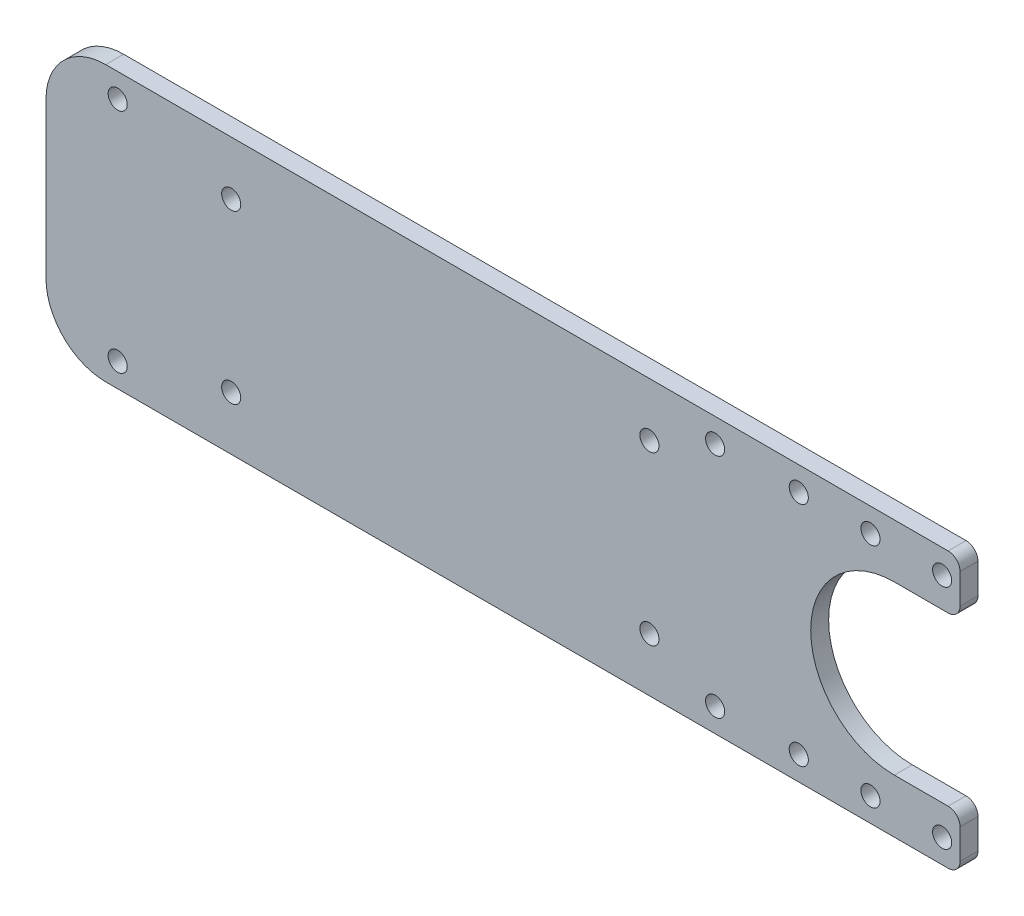
ISO-10303-21;
HEADER;
FILE_DESCRIPTION(('STEP AP214'),'2;1');
FILE_NAME('part.step','',(''),(''),'','','');
FILE_SCHEMA(('AUTOMOTIVE_DESIGN { 1 0 10303 214 1 1 1 1 }'));
ENDSEC;
DATA;
#1=APPLICATION_CONTEXT('core data for automotive mechanical design processes');
#2=APPLICATION_PROTOCOL_DEFINITION('international standard','automotive_design',2000,#1);
#3=PRODUCT_CONTEXT('',#1,'mechanical');
#4=PRODUCT('Part','Part','',(#3));
#5=PRODUCT_RELATED_PRODUCT_CATEGORY('part','',(#4));
#6=PRODUCT_DEFINITION_FORMATION('','',#4);
#7=PRODUCT_DEFINITION_CONTEXT('part definition',#1,'design');
#8=PRODUCT_DEFINITION('design','',#6,#7);
#9=PRODUCT_DEFINITION_SHAPE('','',#8);
#10=(LENGTH_UNIT() NAMED_UNIT(*) SI_UNIT(.MILLI.,.METRE.));
#11=(NAMED_UNIT(*) PLANE_ANGLE_UNIT() SI_UNIT($,.RADIAN.));
#12=(NAMED_UNIT(*) SI_UNIT($,.STERADIAN.) SOLID_ANGLE_UNIT());
#13=UNCERTAINTY_MEASURE_WITH_UNIT(LENGTH_MEASURE(1.E-05),#10,'distance_accuracy_value','');
#14=(GEOMETRIC_REPRESENTATION_CONTEXT(3) GLOBAL_UNCERTAINTY_ASSIGNED_CONTEXT((#13)) GLOBAL_UNIT_ASSIGNED_CONTEXT((#10,
#11,#12)) REPRESENTATION_CONTEXT('',''));
#15=CARTESIAN_POINT('',(0.,0.,0.));
#16=DIRECTION('',(0.,0.,1.));
#17=DIRECTION('',(1.,0.,0.));
#18=AXIS2_PLACEMENT_3D('',#15,#16,#17);
#19=CARTESIAN_POINT('',(0.,0.,3.));
#20=DIRECTION('',(0.,0.,1.));
#21=DIRECTION('',(1.,0.,0.));
#22=AXIS2_PLACEMENT_3D('',#19,#20,#21);
#23=PLANE('',#22);
#24=CARTESIAN_POINT('',(82.,-19.,3.));
#25=DIRECTION('',(0.,0.,1.));
#26=DIRECTION('',(1.,0.,0.));
#27=AXIS2_PLACEMENT_3D('',#24,#25,#26);
#28=CIRCLE('',#27,1.6);
#29=CARTESIAN_POINT('',(83.6000000000001,-19.,3.));
#30=VERTEX_POINT('',#29);
#31=EDGE_CURVE('E215',#30,#30,#28,.T.);
#32=ORIENTED_EDGE('',*,*,#31,.F.);
#33=EDGE_LOOP('',(#32));
#34=FACE_BOUND('',#33,.T.);
#35=CARTESIAN_POINT('',(82.,19.,3.));
#36=DIRECTION('',(0.,0.,1.));
#37=DIRECTION('',(1.,0.,0.));
#38=AXIS2_PLACEMENT_3D('',#35,#36,#37);
#39=CIRCLE('',#38,1.6);
#40=CARTESIAN_POINT('',(83.6000000000001,19.,3.));
#41=VERTEX_POINT('',#40);
#42=EDGE_CURVE('E221',#41,#41,#39,.T.);
#43=ORIENTED_EDGE('',*,*,#42,.F.);
#44=EDGE_LOOP('',(#43));
#45=FACE_BOUND('',#44,.T.);
#46=CARTESIAN_POINT('',(70.,19.,3.));
#47=DIRECTION('',(0.,0.,1.));
#48=DIRECTION('',(1.,0.,0.));
#49=AXIS2_PLACEMENT_3D('',#46,#47,#48);
#50=CIRCLE('',#49,1.6);
#51=CARTESIAN_POINT('',(71.6,19.,3.));
#52=VERTEX_POINT('',#51);
#53=EDGE_CURVE('E227',#52,#52,#50,.T.);
#54=ORIENTED_EDGE('',*,*,#53,.F.);
#55=EDGE_LOOP('',(#54));
#56=FACE_BOUND('',#55,.T.);
#57=CARTESIAN_POINT('',(-44.,19.,3.));
#58=DIRECTION('',(0.,0.,1.));
#59=DIRECTION('',(1.,0.,0.));
#60=AXIS2_PLACEMENT_3D('',#57,#58,#59);
#61=CIRCLE('',#60,1.6);
#62=CARTESIAN_POINT('',(-42.4,19.,3.));
#63=VERTEX_POINT('',#62);
#64=EDGE_CURVE('E194',#63,#63,#61,.T.);
#65=ORIENTED_EDGE('',*,*,#64,.F.);
#66=EDGE_LOOP('',(#65));
#67=FACE_BOUND('',#66,.T.);
#68=CARTESIAN_POINT('',(56.,-19.,3.));
#69=DIRECTION('',(0.,0.,1.));
#70=DIRECTION('',(1.,0.,0.));
#71=AXIS2_PLACEMENT_3D('',#68,#69,#70);
#72=CIRCLE('',#71,1.6);
#73=CARTESIAN_POINT('',(57.6,-19.,3.));
#74=VERTEX_POINT('',#73);
#75=EDGE_CURVE('E201',#74,#74,#72,.F.);
#76=ORIENTED_EDGE('',*,*,#75,.T.);
#77=EDGE_LOOP('',(#76));
#78=FACE_BOUND('',#77,.T.);
#79=CARTESIAN_POINT('',(56.,19.,3.));
#80=DIRECTION('',(0.,0.,1.));
#81=DIRECTION('',(1.,0.,0.));
#82=AXIS2_PLACEMENT_3D('',#79,#80,#81);
#83=CIRCLE('',#82,1.6);
#84=CARTESIAN_POINT('',(57.6,19.,3.));
#85=VERTEX_POINT('',#84);
#86=EDGE_CURVE('E158',#85,#85,#83,.T.);
#87=ORIENTED_EDGE('',*,*,#86,.F.);
#88=EDGE_LOOP('',(#87));
#89=FACE_BOUND('',#88,.T.);
#90=DIRECTION('',(0.,1.,0.));
#91=VECTOR('',#90,1.);
#92=CARTESIAN_POINT('',(-56.,0.,3.));
#93=LINE('',#92,#91);
#94=CARTESIAN_POINT('',(-56.,-13.,3.));
#95=VERTEX_POINT('',#94);
#96=CARTESIAN_POINT('',(-56.,13.,3.));
#97=VERTEX_POINT('',#96);
#98=EDGE_CURVE('E251',#95,#97,#93,.T.);
#99=ORIENTED_EDGE('',*,*,#98,.F.);
#100=CARTESIAN_POINT('',(-46.,-13.,3.));
#101=DIRECTION('',(0.,0.,1.));
#102=DIRECTION('',(1.,0.,0.));
#103=AXIS2_PLACEMENT_3D('',#100,#101,#102);
#104=CIRCLE('',#103,10.);
#105=CARTESIAN_POINT('',(-46.,-23.,3.));
#106=VERTEX_POINT('',#105);
#107=EDGE_CURVE('E43',#95,#106,#104,.T.);
#108=ORIENTED_EDGE('',*,*,#107,.T.);
#109=DIRECTION('',(-1.,0.,0.));
#110=VECTOR('',#109,1.);
#111=CARTESIAN_POINT('',(0.,-23.,3.));
#112=LINE('',#111,#110);
#113=CARTESIAN_POINT('',(95.,-23.,3.));
#114=VERTEX_POINT('',#113);
#115=EDGE_CURVE('E253',#114,#106,#112,.T.);
#116=ORIENTED_EDGE('',*,*,#115,.F.);
#117=CARTESIAN_POINT('',(95.,-21.,3.));
#118=DIRECTION('',(0.,0.,1.));
#119=DIRECTION('',(1.,0.,0.));
#120=AXIS2_PLACEMENT_3D('',#117,#118,#119);
#121=CIRCLE('',#120,2.);
#122=CARTESIAN_POINT('',(97.,-21.,3.));
#123=VERTEX_POINT('',#122);
#124=EDGE_CURVE('E282',#114,#123,#121,.T.);
#125=ORIENTED_EDGE('',*,*,#124,.T.);
#126=DIRECTION('',(0.,-1.,0.));
#127=VECTOR('',#126,1.);
#128=CARTESIAN_POINT('',(96.9999999999999,4.48715139119334E-13,3.));
#129=LINE('',#128,#127);
#130=CARTESIAN_POINT('',(97.,-16.,3.));
#131=VERTEX_POINT('',#130);
#132=EDGE_CURVE('E168',#131,#123,#129,.T.);
#133=ORIENTED_EDGE('',*,*,#132,.F.);
#134=CARTESIAN_POINT('',(95.,-16.,3.));
#135=DIRECTION('',(0.,0.,1.));
#136=DIRECTION('',(1.,0.,0.));
#137=AXIS2_PLACEMENT_3D('',#134,#135,#136);
#138=CIRCLE('',#137,2.);
#139=CARTESIAN_POINT('',(95.,-14.,3.));
#140=VERTEX_POINT('',#139);
#141=EDGE_CURVE('E162',#131,#140,#138,.T.);
#142=ORIENTED_EDGE('',*,*,#141,.T.);
#143=DIRECTION('',(1.,0.,0.));
#144=VECTOR('',#143,1.);
#145=CARTESIAN_POINT('',(0.,-14.0000000000001,3.));
#146=LINE('',#145,#144);
#147=CARTESIAN_POINT('',(86.,-14.,3.));
#148=VERTEX_POINT('',#147);
#149=EDGE_CURVE('E154',#148,#140,#146,.T.);
#150=ORIENTED_EDGE('',*,*,#149,.F.);
#151=CARTESIAN_POINT('',(86.,0.,3.));
#152=DIRECTION('',(0.,0.,1.));
#153=DIRECTION('',(1.,0.,0.));
#154=AXIS2_PLACEMENT_3D('',#151,#152,#153);
#155=CIRCLE('',#154,14.);
#156=CARTESIAN_POINT('',(86.,14.,3.));
#157=VERTEX_POINT('',#156);
#158=EDGE_CURVE('E138',#157,#148,#155,.T.);
#159=ORIENTED_EDGE('',*,*,#158,.F.);
#160=DIRECTION('',(1.,0.,0.));
#161=VECTOR('',#160,1.);
#162=CARTESIAN_POINT('',(0.,14.0000000000001,3.));
#163=LINE('',#162,#161);
#164=CARTESIAN_POINT('',(95.,14.,3.));
#165=VERTEX_POINT('',#164);
#166=EDGE_CURVE('E188',#157,#165,#163,.T.);
#167=ORIENTED_EDGE('',*,*,#166,.T.);
#168=CARTESIAN_POINT('',(95.,16.,3.));
#169=DIRECTION('',(0.,0.,1.));
#170=DIRECTION('',(1.,0.,0.));
#171=AXIS2_PLACEMENT_3D('',#168,#169,#170);
#172=CIRCLE('',#171,2.);
#173=CARTESIAN_POINT('',(97.,16.,3.));
#174=VERTEX_POINT('',#173);
#175=EDGE_CURVE('E301',#165,#174,#172,.T.);
#176=ORIENTED_EDGE('',*,*,#175,.T.);
#177=DIRECTION('',(0.,1.,0.));
#178=VECTOR('',#177,1.);
#179=CARTESIAN_POINT('',(96.9999999999999,-5.98286852159113E-13,3.));
#180=LINE('',#179,#178);
#181=CARTESIAN_POINT('',(97.,21.,3.));
#182=VERTEX_POINT('',#181);
#183=EDGE_CURVE('E181',#174,#182,#180,.T.);
#184=ORIENTED_EDGE('',*,*,#183,.T.);
#185=CARTESIAN_POINT('',(95.,21.,3.));
#186=DIRECTION('',(0.,0.,1.));
#187=DIRECTION('',(1.,0.,0.));
#188=AXIS2_PLACEMENT_3D('',#185,#186,#187);
#189=CIRCLE('',#188,2.);
#190=CARTESIAN_POINT('',(95.,23.,3.));
#191=VERTEX_POINT('',#190);
#192=EDGE_CURVE('E285',#182,#191,#189,.T.);
#193=ORIENTED_EDGE('',*,*,#192,.T.);
#194=DIRECTION('',(-1.,0.,0.));
#195=VECTOR('',#194,1.);
#196=CARTESIAN_POINT('',(0.,23.,3.));
#197=LINE('',#196,#195);
#198=CARTESIAN_POINT('',(-46.,23.,3.));
#199=VERTEX_POINT('',#198);
#200=EDGE_CURVE('E256',#191,#199,#197,.T.);
#201=ORIENTED_EDGE('',*,*,#200,.T.);
#202=CARTESIAN_POINT('',(-46.,13.,3.));
#203=DIRECTION('',(0.,0.,1.));
#204=DIRECTION('',(1.,0.,0.));
#205=AXIS2_PLACEMENT_3D('',#202,#203,#204);
#206=CIRCLE('',#205,10.);
#207=EDGE_CURVE('E55',#199,#97,#206,.T.);
#208=ORIENTED_EDGE('',*,*,#207,.T.);
#209=EDGE_LOOP('',(#99,#108,#116,#125,#133,#142,#150,#159,#167,#176,#184,#193,#201,#208));
#210=FACE_BOUND('',#209,.T.);
#211=CARTESIAN_POINT('',(70.,-19.,3.));
#212=DIRECTION('',(0.,0.,1.));
#213=DIRECTION('',(1.,0.,0.));
#214=AXIS2_PLACEMENT_3D('',#211,#212,#213);
#215=CIRCLE('',#214,1.6);
#216=CARTESIAN_POINT('',(71.6,-19.,3.));
#217=VERTEX_POINT('',#216);
#218=EDGE_CURVE('E214',#217,#217,#215,.T.);
#219=ORIENTED_EDGE('',*,*,#218,.F.);
#220=EDGE_LOOP('',(#219));
#221=FACE_BOUND('',#220,.T.);
#222=CARTESIAN_POINT('',(45.,-14.,3.));
#223=DIRECTION('',(0.,0.,1.));
#224=DIRECTION('',(1.,0.,0.));
#225=AXIS2_PLACEMENT_3D('',#222,#223,#224);
#226=CIRCLE('',#225,1.6);
#227=CARTESIAN_POINT('',(46.6,-14.,3.));
#228=VERTEX_POINT('',#227);
#229=EDGE_CURVE('E241',#228,#228,#226,.T.);
#230=ORIENTED_EDGE('',*,*,#229,.F.);
#231=EDGE_LOOP('',(#230));
#232=FACE_BOUND('',#231,.T.);
#233=CARTESIAN_POINT('',(-25.,14.,3.));
#234=DIRECTION('',(0.,0.,1.));
#235=DIRECTION('',(1.,0.,0.));
#236=AXIS2_PLACEMENT_3D('',#233,#234,#235);
#237=CIRCLE('',#236,1.6);
#238=CARTESIAN_POINT('',(-23.4,14.,3.));
#239=VERTEX_POINT('',#238);
#240=EDGE_CURVE('E244',#239,#239,#237,.T.);
#241=ORIENTED_EDGE('',*,*,#240,.F.);
#242=EDGE_LOOP('',(#241));
#243=FACE_BOUND('',#242,.T.);
#244=CARTESIAN_POINT('',(-25.,-14.,3.));
#245=DIRECTION('',(0.,0.,1.));
#246=DIRECTION('',(1.,0.,0.));
#247=AXIS2_PLACEMENT_3D('',#244,#245,#246);
#248=CIRCLE('',#247,1.6);
#249=CARTESIAN_POINT('',(-23.4,-14.,3.));
#250=VERTEX_POINT('',#249);
#251=EDGE_CURVE('E248',#250,#250,#248,.F.);
#252=ORIENTED_EDGE('',*,*,#251,.T.);
#253=EDGE_LOOP('',(#252));
#254=FACE_BOUND('',#253,.T.);
#255=CARTESIAN_POINT('',(45.,14.,3.));
#256=DIRECTION('',(0.,0.,1.));
#257=DIRECTION('',(1.,0.,0.));
#258=AXIS2_PLACEMENT_3D('',#255,#256,#257);
#259=CIRCLE('',#258,1.6);
#260=CARTESIAN_POINT('',(46.6,14.,3.));
#261=VERTEX_POINT('',#260);
#262=EDGE_CURVE('E258',#261,#261,#259,.F.);
#263=ORIENTED_EDGE('',*,*,#262,.T.);
#264=EDGE_LOOP('',(#263));
#265=FACE_BOUND('',#264,.T.);
#266=CARTESIAN_POINT('',(-44.,-19.,3.));
#267=DIRECTION('',(0.,0.,1.));
#268=DIRECTION('',(1.,0.,0.));
#269=AXIS2_PLACEMENT_3D('',#266,#267,#268);
#270=CIRCLE('',#269,1.6);
#271=CARTESIAN_POINT('',(-42.4,-19.,3.));
#272=VERTEX_POINT('',#271);
#273=EDGE_CURVE('E195',#272,#272,#270,.F.);
#274=ORIENTED_EDGE('',*,*,#273,.T.);
#275=EDGE_LOOP('',(#274));
#276=FACE_BOUND('',#275,.T.);
#277=CARTESIAN_POINT('',(94.,19.,3.));
#278=DIRECTION('',(0.,0.,1.));
#279=DIRECTION('',(1.,0.,0.));
#280=AXIS2_PLACEMENT_3D('',#277,#278,#279);
#281=CIRCLE('',#280,1.6);
#282=CARTESIAN_POINT('',(95.6000000000001,19.,3.));
#283=VERTEX_POINT('',#282);
#284=EDGE_CURVE('E177',#283,#283,#281,.T.);
#285=ORIENTED_EDGE('',*,*,#284,.F.);
#286=EDGE_LOOP('',(#285));
#287=FACE_BOUND('',#286,.T.);
#288=CARTESIAN_POINT('',(94.,-19.,3.));
#289=DIRECTION('',(0.,0.,1.));
#290=DIRECTION('',(1.,0.,0.));
#291=AXIS2_PLACEMENT_3D('',#288,#289,#290);
#292=CIRCLE('',#291,1.59999999999999);
#293=CARTESIAN_POINT('',(95.6,-19.,3.));
#294=VERTEX_POINT('',#293);
#295=EDGE_CURVE('E163',#294,#294,#292,.F.);
#296=ORIENTED_EDGE('',*,*,#295,.T.);
#297=EDGE_LOOP('',(#296));
#298=FACE_BOUND('',#297,.T.);
#299=ADVANCED_FACE('F35',(#34,#45,#56,#67,#78,#89,#210,#221,#232,#243,#254,#265,#276,#287,#298),
#23,.T.);
#300=CARTESIAN_POINT('',(0.,0.,0.));
#301=DIRECTION('',(0.,0.,1.));
#302=DIRECTION('',(1.,0.,0.));
#303=AXIS2_PLACEMENT_3D('',#300,#301,#302);
#304=PLANE('',#303);
#305=CARTESIAN_POINT('',(82.,-19.,0.));
#306=DIRECTION('',(0.,0.,1.));
#307=DIRECTION('',(1.,0.,0.));
#308=AXIS2_PLACEMENT_3D('',#305,#306,#307);
#309=CIRCLE('',#308,1.6);
#310=CARTESIAN_POINT('',(83.6000000000001,-19.,0.));
#311=VERTEX_POINT('',#310);
#312=EDGE_CURVE('E211',#311,#311,#309,.T.);
#313=ORIENTED_EDGE('',*,*,#312,.T.);
#314=EDGE_LOOP('',(#313));
#315=FACE_BOUND('',#314,.T.);
#316=CARTESIAN_POINT('',(82.,19.,0.));
#317=DIRECTION('',(0.,0.,1.));
#318=DIRECTION('',(1.,0.,0.));
#319=AXIS2_PLACEMENT_3D('',#316,#317,#318);
#320=CIRCLE('',#319,1.6);
#321=CARTESIAN_POINT('',(83.6000000000001,19.,0.));
#322=VERTEX_POINT('',#321);
#323=EDGE_CURVE('E218',#322,#322,#320,.T.);
#324=ORIENTED_EDGE('',*,*,#323,.T.);
#325=EDGE_LOOP('',(#324));
#326=FACE_BOUND('',#325,.T.);
#327=CARTESIAN_POINT('',(70.,19.,0.));
#328=DIRECTION('',(0.,0.,1.));
#329=DIRECTION('',(1.,0.,0.));
#330=AXIS2_PLACEMENT_3D('',#327,#328,#329);
#331=CIRCLE('',#330,1.6);
#332=CARTESIAN_POINT('',(71.6,19.,0.));
#333=VERTEX_POINT('',#332);
#334=EDGE_CURVE('E224',#333,#333,#331,.T.);
#335=ORIENTED_EDGE('',*,*,#334,.T.);
#336=EDGE_LOOP('',(#335));
#337=FACE_BOUND('',#336,.T.);
#338=CARTESIAN_POINT('',(-44.,19.,0.));
#339=DIRECTION('',(0.,0.,1.));
#340=DIRECTION('',(1.,0.,0.));
#341=AXIS2_PLACEMENT_3D('',#338,#339,#340);
#342=CIRCLE('',#341,1.6);
#343=CARTESIAN_POINT('',(-42.4,19.,0.));
#344=VERTEX_POINT('',#343);
#345=EDGE_CURVE('E230',#344,#344,#342,.T.);
#346=ORIENTED_EDGE('',*,*,#345,.T.);
#347=EDGE_LOOP('',(#346));
#348=FACE_BOUND('',#347,.T.);
#349=CARTESIAN_POINT('',(56.,19.,0.));
#350=DIRECTION('',(0.,0.,1.));
#351=DIRECTION('',(1.,0.,0.));
#352=AXIS2_PLACEMENT_3D('',#349,#350,#351);
#353=CIRCLE('',#352,1.6);
#354=CARTESIAN_POINT('',(57.6,19.,0.));
#355=VERTEX_POINT('',#354);
#356=EDGE_CURVE('E204',#355,#355,#353,.T.);
#357=ORIENTED_EDGE('',*,*,#356,.T.);
#358=EDGE_LOOP('',(#357));
#359=FACE_BOUND('',#358,.T.);
#360=CARTESIAN_POINT('',(70.,-19.,0.));
#361=DIRECTION('',(0.,0.,1.));
#362=DIRECTION('',(1.,0.,0.));
#363=AXIS2_PLACEMENT_3D('',#360,#361,#362);
#364=CIRCLE('',#363,1.6);
#365=CARTESIAN_POINT('',(71.6,-19.,0.));
#366=VERTEX_POINT('',#365);
#367=EDGE_CURVE('E235',#366,#366,#364,.T.);
#368=ORIENTED_EDGE('',*,*,#367,.T.);
#369=EDGE_LOOP('',(#368));
#370=FACE_BOUND('',#369,.T.);
#371=CARTESIAN_POINT('',(45.,-14.,0.));
#372=DIRECTION('',(0.,0.,1.));
#373=DIRECTION('',(1.,0.,0.));
#374=AXIS2_PLACEMENT_3D('',#371,#372,#373);
#375=CIRCLE('',#374,1.6);
#376=CARTESIAN_POINT('',(46.6,-14.,0.));
#377=VERTEX_POINT('',#376);
#378=EDGE_CURVE('E238',#377,#377,#375,.T.);
#379=ORIENTED_EDGE('',*,*,#378,.T.);
#380=EDGE_LOOP('',(#379));
#381=FACE_BOUND('',#380,.T.);
#382=CARTESIAN_POINT('',(-25.,14.,0.));
#383=DIRECTION('',(0.,0.,1.));
#384=DIRECTION('',(1.,0.,0.));
#385=AXIS2_PLACEMENT_3D('',#382,#383,#384);
#386=CIRCLE('',#385,1.6);
#387=CARTESIAN_POINT('',(-23.4,14.,0.));
#388=VERTEX_POINT('',#387);
#389=EDGE_CURVE('E264',#388,#388,#386,.T.);
#390=ORIENTED_EDGE('',*,*,#389,.T.);
#391=EDGE_LOOP('',(#390));
#392=FACE_BOUND('',#391,.T.);
#393=CARTESIAN_POINT('',(-25.,-14.,0.));
#394=DIRECTION('',(0.,0.,1.));
#395=DIRECTION('',(1.,0.,0.));
#396=AXIS2_PLACEMENT_3D('',#393,#394,#395);
#397=CIRCLE('',#396,1.6);
#398=CARTESIAN_POINT('',(-23.4,-14.,0.));
#399=VERTEX_POINT('',#398);
#400=EDGE_CURVE('E267',#399,#399,#397,.F.);
#401=ORIENTED_EDGE('',*,*,#400,.F.);
#402=EDGE_LOOP('',(#401));
#403=FACE_BOUND('',#402,.T.);
#404=DIRECTION('',(-1.,0.,0.));
#405=VECTOR('',#404,1.);
#406=CARTESIAN_POINT('',(0.,-23.,0.));
#407=LINE('',#406,#405);
#408=CARTESIAN_POINT('',(95.,-23.,0.));
#409=VERTEX_POINT('',#408);
#410=CARTESIAN_POINT('',(-46.,-23.,0.));
#411=VERTEX_POINT('',#410);
#412=EDGE_CURVE('E273',#409,#411,#407,.T.);
#413=ORIENTED_EDGE('',*,*,#412,.T.);
#414=CARTESIAN_POINT('',(-46.,-13.,0.));
#415=DIRECTION('',(0.,0.,1.));
#416=DIRECTION('',(1.,0.,0.));
#417=AXIS2_PLACEMENT_3D('',#414,#415,#416);
#418=CIRCLE('',#417,10.);
#419=CARTESIAN_POINT('',(-56.,-13.,0.));
#420=VERTEX_POINT('',#419);
#421=EDGE_CURVE('E320',#411,#420,#418,.F.);
#422=ORIENTED_EDGE('',*,*,#421,.T.);
#423=DIRECTION('',(0.,1.,0.));
#424=VECTOR('',#423,1.);
#425=CARTESIAN_POINT('',(-56.,0.,0.));
#426=LINE('',#425,#424);
#427=CARTESIAN_POINT('',(-56.,13.,0.));
#428=VERTEX_POINT('',#427);
#429=EDGE_CURVE('E270',#420,#428,#426,.T.);
#430=ORIENTED_EDGE('',*,*,#429,.T.);
#431=CARTESIAN_POINT('',(-46.,13.,0.));
#432=DIRECTION('',(0.,0.,1.));
#433=DIRECTION('',(1.,0.,0.));
#434=AXIS2_PLACEMENT_3D('',#431,#432,#433);
#435=CIRCLE('',#434,10.);
#436=CARTESIAN_POINT('',(-46.,23.,0.));
#437=VERTEX_POINT('',#436);
#438=EDGE_CURVE('E318',#428,#437,#435,.F.);
#439=ORIENTED_EDGE('',*,*,#438,.T.);
#440=DIRECTION('',(-1.,0.,0.));
#441=VECTOR('',#440,1.);
#442=CARTESIAN_POINT('',(0.,23.,0.));
#443=LINE('',#442,#441);
#444=CARTESIAN_POINT('',(95.,23.,0.));
#445=VERTEX_POINT('',#444);
#446=EDGE_CURVE('E276',#445,#437,#443,.T.);
#447=ORIENTED_EDGE('',*,*,#446,.F.);
#448=CARTESIAN_POINT('',(95.,21.,0.));
#449=DIRECTION('',(0.,0.,1.));
#450=DIRECTION('',(1.,0.,0.));
#451=AXIS2_PLACEMENT_3D('',#448,#449,#450);
#452=CIRCLE('',#451,2.);
#453=CARTESIAN_POINT('',(97.,21.,0.));
#454=VERTEX_POINT('',#453);
#455=EDGE_CURVE('E291',#445,#454,#452,.F.);
#456=ORIENTED_EDGE('',*,*,#455,.T.);
#457=DIRECTION('',(0.,-1.,0.));
#458=VECTOR('',#457,1.);
#459=CARTESIAN_POINT('',(96.9999999999999,-5.98286852159113E-13,0.));
#460=LINE('',#459,#458);
#461=CARTESIAN_POINT('',(97.,16.,0.));
#462=VERTEX_POINT('',#461);
#463=EDGE_CURVE('E180',#454,#462,#460,.T.);
#464=ORIENTED_EDGE('',*,*,#463,.T.);
#465=CARTESIAN_POINT('',(95.,16.,0.));
#466=DIRECTION('',(0.,0.,1.));
#467=DIRECTION('',(1.,0.,0.));
#468=AXIS2_PLACEMENT_3D('',#465,#466,#467);
#469=CIRCLE('',#468,2.);
#470=CARTESIAN_POINT('',(95.,14.,0.));
#471=VERTEX_POINT('',#470);
#472=EDGE_CURVE('E306',#462,#471,#469,.F.);
#473=ORIENTED_EDGE('',*,*,#472,.T.);
#474=DIRECTION('',(-1.,0.,0.));
#475=VECTOR('',#474,1.);
#476=CARTESIAN_POINT('',(0.,14.0000000000001,0.));
#477=LINE('',#476,#475);
#478=CARTESIAN_POINT('',(86.,14.,0.));
#479=VERTEX_POINT('',#478);
#480=EDGE_CURVE('E178',#471,#479,#477,.T.);
#481=ORIENTED_EDGE('',*,*,#480,.T.);
#482=CARTESIAN_POINT('',(86.,0.,0.));
#483=DIRECTION('',(0.,0.,1.));
#484=DIRECTION('',(1.,0.,0.));
#485=AXIS2_PLACEMENT_3D('',#482,#483,#484);
#486=CIRCLE('',#485,14.);
#487=CARTESIAN_POINT('',(86.,-14.,0.));
#488=VERTEX_POINT('',#487);
#489=EDGE_CURVE('E148',#479,#488,#486,.T.);
#490=ORIENTED_EDGE('',*,*,#489,.T.);
#491=DIRECTION('',(-1.,0.,0.));
#492=VECTOR('',#491,1.);
#493=CARTESIAN_POINT('',(0.,-14.0000000000001,0.));
#494=LINE('',#493,#492);
#495=CARTESIAN_POINT('',(95.,-14.,0.));
#496=VERTEX_POINT('',#495);
#497=EDGE_CURVE('E157',#496,#488,#494,.T.);
#498=ORIENTED_EDGE('',*,*,#497,.F.);
#499=CARTESIAN_POINT('',(95.,-16.,0.));
#500=DIRECTION('',(0.,0.,1.));
#501=DIRECTION('',(1.,0.,0.));
#502=AXIS2_PLACEMENT_3D('',#499,#500,#501);
#503=CIRCLE('',#502,2.);
#504=CARTESIAN_POINT('',(97.,-16.,0.));
#505=VERTEX_POINT('',#504);
#506=EDGE_CURVE('E308',#496,#505,#503,.F.);
#507=ORIENTED_EDGE('',*,*,#506,.T.);
#508=DIRECTION('',(0.,1.,0.));
#509=VECTOR('',#508,1.);
#510=CARTESIAN_POINT('',(96.9999999999999,4.48715139119334E-13,0.));
#511=LINE('',#510,#509);
#512=CARTESIAN_POINT('',(97.,-21.,0.));
#513=VERTEX_POINT('',#512);
#514=EDGE_CURVE('E172',#513,#505,#511,.T.);
#515=ORIENTED_EDGE('',*,*,#514,.F.);
#516=CARTESIAN_POINT('',(95.,-21.,0.));
#517=DIRECTION('',(0.,0.,1.));
#518=DIRECTION('',(1.,0.,0.));
#519=AXIS2_PLACEMENT_3D('',#516,#517,#518);
#520=CIRCLE('',#519,2.);
#521=EDGE_CURVE('E289',#513,#409,#520,.F.);
#522=ORIENTED_EDGE('',*,*,#521,.T.);
#523=EDGE_LOOP('',(#413,#422,#430,#439,#447,#456,#464,#473,#481,#490,#498,#507,#515,#522));
#524=FACE_BOUND('',#523,.T.);
#525=CARTESIAN_POINT('',(45.,14.,0.));
#526=DIRECTION('',(0.,0.,1.));
#527=DIRECTION('',(1.,0.,0.));
#528=AXIS2_PLACEMENT_3D('',#525,#526,#527);
#529=CIRCLE('',#528,1.6);
#530=CARTESIAN_POINT('',(46.6,14.,0.));
#531=VERTEX_POINT('',#530);
#532=EDGE_CURVE('E245',#531,#531,#529,.F.);
#533=ORIENTED_EDGE('',*,*,#532,.F.);
#534=EDGE_LOOP('',(#533));
#535=FACE_BOUND('',#534,.T.);
#536=CARTESIAN_POINT('',(56.,-19.,0.));
#537=DIRECTION('',(0.,0.,1.));
#538=DIRECTION('',(1.,0.,0.));
#539=AXIS2_PLACEMENT_3D('',#536,#537,#538);
#540=CIRCLE('',#539,1.6);
#541=CARTESIAN_POINT('',(57.6,-19.,0.));
#542=VERTEX_POINT('',#541);
#543=EDGE_CURVE('E198',#542,#542,#540,.F.);
#544=ORIENTED_EDGE('',*,*,#543,.F.);
#545=EDGE_LOOP('',(#544));
#546=FACE_BOUND('',#545,.T.);
#547=CARTESIAN_POINT('',(-44.,-19.,0.));
#548=DIRECTION('',(0.,0.,1.));
#549=DIRECTION('',(1.,0.,0.));
#550=AXIS2_PLACEMENT_3D('',#547,#548,#549);
#551=CIRCLE('',#550,1.6);
#552=CARTESIAN_POINT('',(-42.4,-19.,0.));
#553=VERTEX_POINT('',#552);
#554=EDGE_CURVE('E191',#553,#553,#551,.F.);
#555=ORIENTED_EDGE('',*,*,#554,.F.);
#556=EDGE_LOOP('',(#555));
#557=FACE_BOUND('',#556,.T.);
#558=CARTESIAN_POINT('',(94.,19.,0.));
#559=DIRECTION('',(0.,0.,1.));
#560=DIRECTION('',(1.,0.,0.));
#561=AXIS2_PLACEMENT_3D('',#558,#559,#560);
#562=CIRCLE('',#561,1.6);
#563=CARTESIAN_POINT('',(95.6000000000001,19.,0.));
#564=VERTEX_POINT('',#563);
#565=EDGE_CURVE('E149',#564,#564,#562,.F.);
#566=ORIENTED_EDGE('',*,*,#565,.F.);
#567=EDGE_LOOP('',(#566));
#568=FACE_BOUND('',#567,.T.);
#569=CARTESIAN_POINT('',(94.,-19.,0.));
#570=DIRECTION('',(0.,0.,1.));
#571=DIRECTION('',(1.,0.,0.));
#572=AXIS2_PLACEMENT_3D('',#569,#570,#571);
#573=CIRCLE('',#572,1.59999999999999);
#574=CARTESIAN_POINT('',(95.6,-19.,0.));
#575=VERTEX_POINT('',#574);
#576=EDGE_CURVE('E166',#575,#575,#573,.T.);
#577=ORIENTED_EDGE('',*,*,#576,.T.);
#578=EDGE_LOOP('',(#577));
#579=FACE_BOUND('',#578,.T.);
#580=ADVANCED_FACE('F339',(#315,#326,#337,#348,#359,#370,#381,#392,#403,#524,#535,#546,#557,
#568,#579),#304,.F.);
#581=CARTESIAN_POINT('',(-56.,0.,3.));
#582=DIRECTION('',(-1.,0.,0.));
#583=DIRECTION('',(0.,-1.,0.));
#584=AXIS2_PLACEMENT_3D('',#581,#582,#583);
#585=PLANE('',#584);
#586=ORIENTED_EDGE('',*,*,#429,.F.);
#587=DIRECTION('',(0.,0.,-1.));
#588=VECTOR('',#587,1.);
#589=CARTESIAN_POINT('',(-56.,-13.,3.));
#590=LINE('',#589,#588);
#591=EDGE_CURVE('E325',#420,#95,#590,.F.);
#592=ORIENTED_EDGE('',*,*,#591,.T.);
#593=ORIENTED_EDGE('',*,*,#98,.T.);
#594=DIRECTION('',(0.,0.,-1.));
#595=VECTOR('',#594,1.);
#596=CARTESIAN_POINT('',(-56.,13.,0.));
#597=LINE('',#596,#595);
#598=EDGE_CURVE('E322',#97,#428,#597,.T.);
#599=ORIENTED_EDGE('',*,*,#598,.T.);
#600=EDGE_LOOP('',(#586,#592,#593,#599));
#601=FACE_BOUND('',#600,.T.);
#602=ADVANCED_FACE('F342',(#601),#585,.T.);
#603=CARTESIAN_POINT('',(0.,-23.,3.));
#604=DIRECTION('',(0.,-1.,0.));
#605=DIRECTION('',(1.,0.,0.));
#606=AXIS2_PLACEMENT_3D('',#603,#604,#605);
#607=PLANE('',#606);
#608=ORIENTED_EDGE('',*,*,#115,.T.);
#609=DIRECTION('',(0.,0.,-1.));
#610=VECTOR('',#609,1.);
#611=CARTESIAN_POINT('',(-46.,-23.,3.));
#612=LINE('',#611,#610);
#613=EDGE_CURVE('E315',#106,#411,#612,.T.);
#614=ORIENTED_EDGE('',*,*,#613,.T.);
#615=ORIENTED_EDGE('',*,*,#412,.F.);
#616=DIRECTION('',(0.,0.,1.));
#617=VECTOR('',#616,1.);
#618=CARTESIAN_POINT('',(95.,-23.,3.));
#619=LINE('',#618,#617);
#620=EDGE_CURVE('E293',#409,#114,#619,.T.);
#621=ORIENTED_EDGE('',*,*,#620,.T.);
#622=EDGE_LOOP('',(#608,#614,#615,#621));
#623=FACE_BOUND('',#622,.T.);
#624=ADVANCED_FACE('F333',(#623),#607,.T.);
#625=CARTESIAN_POINT('',(0.,23.,3.));
#626=DIRECTION('',(0.,-1.,0.));
#627=DIRECTION('',(1.,0.,0.));
#628=AXIS2_PLACEMENT_3D('',#625,#626,#627);
#629=PLANE('',#628);
#630=ORIENTED_EDGE('',*,*,#446,.T.);
#631=DIRECTION('',(0.,0.,-1.));
#632=VECTOR('',#631,1.);
#633=CARTESIAN_POINT('',(-46.,23.,3.));
#634=LINE('',#633,#632);
#635=EDGE_CURVE('E11',#437,#199,#634,.F.);
#636=ORIENTED_EDGE('',*,*,#635,.T.);
#637=ORIENTED_EDGE('',*,*,#200,.F.);
#638=DIRECTION('',(0.,0.,1.));
#639=VECTOR('',#638,1.);
#640=CARTESIAN_POINT('',(95.,23.,0.));
#641=LINE('',#640,#639);
#642=EDGE_CURVE('E287',#191,#445,#641,.F.);
#643=ORIENTED_EDGE('',*,*,#642,.T.);
#644=EDGE_LOOP('',(#630,#636,#637,#643));
#645=FACE_BOUND('',#644,.T.);
#646=ADVANCED_FACE('F347',(#645),#629,.F.);
#647=CARTESIAN_POINT('',(-25.,-14.,3.));
#648=DIRECTION('',(0.,0.,-1.));
#649=DIRECTION('',(-1.,0.,0.));
#650=AXIS2_PLACEMENT_3D('',#647,#648,#649);
#651=CYLINDRICAL_SURFACE('',#650,1.6);
#652=ORIENTED_EDGE('',*,*,#251,.F.);
#653=EDGE_LOOP('',(#652));
#654=FACE_BOUND('',#653,.T.);
#655=ORIENTED_EDGE('',*,*,#400,.T.);
#656=EDGE_LOOP('',(#655));
#657=FACE_BOUND('',#656,.T.);
#658=ADVANCED_FACE('F407',(#654,#657),#651,.F.);
#659=CARTESIAN_POINT('',(-25.,14.,3.));
#660=DIRECTION('',(0.,0.,-1.));
#661=DIRECTION('',(-1.,0.,0.));
#662=AXIS2_PLACEMENT_3D('',#659,#660,#661);
#663=CYLINDRICAL_SURFACE('',#662,1.6);
#664=ORIENTED_EDGE('',*,*,#240,.T.);
#665=EDGE_LOOP('',(#664));
#666=FACE_BOUND('',#665,.T.);
#667=ORIENTED_EDGE('',*,*,#389,.F.);
#668=EDGE_LOOP('',(#667));
#669=FACE_BOUND('',#668,.T.);
#670=ADVANCED_FACE('F414',(#666,#669),#663,.F.);
#671=CARTESIAN_POINT('',(45.,-14.,3.));
#672=DIRECTION('',(0.,0.,-1.));
#673=DIRECTION('',(-1.,0.,0.));
#674=AXIS2_PLACEMENT_3D('',#671,#672,#673);
#675=CYLINDRICAL_SURFACE('',#674,1.6);
#676=ORIENTED_EDGE('',*,*,#229,.T.);
#677=EDGE_LOOP('',(#676));
#678=FACE_BOUND('',#677,.T.);
#679=ORIENTED_EDGE('',*,*,#378,.F.);
#680=EDGE_LOOP('',(#679));
#681=FACE_BOUND('',#680,.T.);
#682=ADVANCED_FACE('F403',(#678,#681),#675,.F.);
#683=CARTESIAN_POINT('',(45.,14.,3.));
#684=DIRECTION('',(0.,0.,-1.));
#685=DIRECTION('',(-1.,0.,0.));
#686=AXIS2_PLACEMENT_3D('',#683,#684,#685);
#687=CYLINDRICAL_SURFACE('',#686,1.6);
#688=ORIENTED_EDGE('',*,*,#262,.F.);
#689=EDGE_LOOP('',(#688));
#690=FACE_BOUND('',#689,.T.);
#691=ORIENTED_EDGE('',*,*,#532,.T.);
#692=EDGE_LOOP('',(#691));
#693=FACE_BOUND('',#692,.T.);
#694=ADVANCED_FACE('F400',(#690,#693),#687,.F.);
#695=CARTESIAN_POINT('',(70.,-19.,0.));
#696=DIRECTION('',(0.,0.,1.));
#697=DIRECTION('',(1.,0.,0.));
#698=AXIS2_PLACEMENT_3D('',#695,#696,#697);
#699=CYLINDRICAL_SURFACE('',#698,1.6);
#700=ORIENTED_EDGE('',*,*,#367,.F.);
#701=EDGE_LOOP('',(#700));
#702=FACE_BOUND('',#701,.T.);
#703=ORIENTED_EDGE('',*,*,#218,.T.);
#704=EDGE_LOOP('',(#703));
#705=FACE_BOUND('',#704,.T.);
#706=ADVANCED_FACE('F397',(#702,#705),#699,.F.);
#707=CARTESIAN_POINT('',(86.,0.,0.));
#708=DIRECTION('',(0.,0.,1.));
#709=DIRECTION('',(1.,0.,0.));
#710=AXIS2_PLACEMENT_3D('',#707,#708,#709);
#711=CYLINDRICAL_SURFACE('',#710,14.);
#712=ORIENTED_EDGE('',*,*,#158,.T.);
#713=DIRECTION('',(0.,0.,1.));
#714=VECTOR('',#713,1.);
#715=CARTESIAN_POINT('',(86.,-14.,0.));
#716=LINE('',#715,#714);
#717=EDGE_CURVE('E142',#488,#148,#716,.T.);
#718=ORIENTED_EDGE('',*,*,#717,.F.);
#719=ORIENTED_EDGE('',*,*,#489,.F.);
#720=DIRECTION('',(0.,0.,1.));
#721=VECTOR('',#720,1.);
#722=CARTESIAN_POINT('',(86.,14.,0.));
#723=LINE('',#722,#721);
#724=EDGE_CURVE('E145',#479,#157,#723,.T.);
#725=ORIENTED_EDGE('',*,*,#724,.T.);
#726=EDGE_LOOP('',(#712,#718,#719,#725));
#727=FACE_BOUND('',#726,.T.);
#728=ADVANCED_FACE('F140',(#727),#711,.F.);
#729=CARTESIAN_POINT('',(56.,19.,0.));
#730=DIRECTION('',(0.,0.,1.));
#731=DIRECTION('',(1.,0.,0.));
#732=AXIS2_PLACEMENT_3D('',#729,#730,#731);
#733=CYLINDRICAL_SURFACE('',#732,1.6);
#734=ORIENTED_EDGE('',*,*,#356,.F.);
#735=EDGE_LOOP('',(#734));
#736=FACE_BOUND('',#735,.T.);
#737=ORIENTED_EDGE('',*,*,#86,.T.);
#738=EDGE_LOOP('',(#737));
#739=FACE_BOUND('',#738,.T.);
#740=ADVANCED_FACE('F474',(#736,#739),#733,.F.);
#741=CARTESIAN_POINT('',(56.,-19.,0.));
#742=DIRECTION('',(0.,0.,1.));
#743=DIRECTION('',(1.,0.,0.));
#744=AXIS2_PLACEMENT_3D('',#741,#742,#743);
#745=CYLINDRICAL_SURFACE('',#744,1.6);
#746=ORIENTED_EDGE('',*,*,#543,.T.);
#747=EDGE_LOOP('',(#746));
#748=FACE_BOUND('',#747,.T.);
#749=ORIENTED_EDGE('',*,*,#75,.F.);
#750=EDGE_LOOP('',(#749));
#751=FACE_BOUND('',#750,.T.);
#752=ADVANCED_FACE('F470',(#748,#751),#745,.F.);
#753=CARTESIAN_POINT('',(-44.,-19.,0.));
#754=DIRECTION('',(0.,0.,1.));
#755=DIRECTION('',(1.,0.,0.));
#756=AXIS2_PLACEMENT_3D('',#753,#754,#755);
#757=CYLINDRICAL_SURFACE('',#756,1.6);
#758=ORIENTED_EDGE('',*,*,#554,.T.);
#759=EDGE_LOOP('',(#758));
#760=FACE_BOUND('',#759,.T.);
#761=ORIENTED_EDGE('',*,*,#273,.F.);
#762=EDGE_LOOP('',(#761));
#763=FACE_BOUND('',#762,.T.);
#764=ADVANCED_FACE('F466',(#760,#763),#757,.F.);
#765=CARTESIAN_POINT('',(-44.,19.,0.));
#766=DIRECTION('',(0.,0.,1.));
#767=DIRECTION('',(1.,0.,0.));
#768=AXIS2_PLACEMENT_3D('',#765,#766,#767);
#769=CYLINDRICAL_SURFACE('',#768,1.6);
#770=ORIENTED_EDGE('',*,*,#345,.F.);
#771=EDGE_LOOP('',(#770));
#772=FACE_BOUND('',#771,.T.);
#773=ORIENTED_EDGE('',*,*,#64,.T.);
#774=EDGE_LOOP('',(#773));
#775=FACE_BOUND('',#774,.T.);
#776=ADVANCED_FACE('F469',(#772,#775),#769,.F.);
#777=CARTESIAN_POINT('',(70.,19.,0.));
#778=DIRECTION('',(0.,0.,1.));
#779=DIRECTION('',(1.,0.,0.));
#780=AXIS2_PLACEMENT_3D('',#777,#778,#779);
#781=CYLINDRICAL_SURFACE('',#780,1.6);
#782=ORIENTED_EDGE('',*,*,#334,.F.);
#783=EDGE_LOOP('',(#782));
#784=FACE_BOUND('',#783,.T.);
#785=ORIENTED_EDGE('',*,*,#53,.T.);
#786=EDGE_LOOP('',(#785));
#787=FACE_BOUND('',#786,.T.);
#788=ADVANCED_FACE('F487',(#784,#787),#781,.F.);
#789=CARTESIAN_POINT('',(82.,19.,0.));
#790=DIRECTION('',(0.,0.,1.));
#791=DIRECTION('',(1.,0.,0.));
#792=AXIS2_PLACEMENT_3D('',#789,#790,#791);
#793=CYLINDRICAL_SURFACE('',#792,1.6);
#794=ORIENTED_EDGE('',*,*,#323,.F.);
#795=EDGE_LOOP('',(#794));
#796=FACE_BOUND('',#795,.T.);
#797=ORIENTED_EDGE('',*,*,#42,.T.);
#798=EDGE_LOOP('',(#797));
#799=FACE_BOUND('',#798,.T.);
#800=ADVANCED_FACE('F483',(#796,#799),#793,.F.);
#801=CARTESIAN_POINT('',(82.,-19.,0.));
#802=DIRECTION('',(0.,0.,1.));
#803=DIRECTION('',(1.,0.,0.));
#804=AXIS2_PLACEMENT_3D('',#801,#802,#803);
#805=CYLINDRICAL_SURFACE('',#804,1.6);
#806=ORIENTED_EDGE('',*,*,#312,.F.);
#807=EDGE_LOOP('',(#806));
#808=FACE_BOUND('',#807,.T.);
#809=ORIENTED_EDGE('',*,*,#31,.T.);
#810=EDGE_LOOP('',(#809));
#811=FACE_BOUND('',#810,.T.);
#812=ADVANCED_FACE('F464',(#808,#811),#805,.F.);
#813=CARTESIAN_POINT('',(94.,19.,-14.2126704035519));
#814=DIRECTION('',(0.,0.,1.));
#815=DIRECTION('',(1.,0.,0.));
#816=AXIS2_PLACEMENT_3D('',#813,#814,#815);
#817=CYLINDRICAL_SURFACE('',#816,1.6);
#818=ORIENTED_EDGE('',*,*,#565,.T.);
#819=EDGE_LOOP('',(#818));
#820=FACE_BOUND('',#819,.T.);
#821=ORIENTED_EDGE('',*,*,#284,.T.);
#822=EDGE_LOOP('',(#821));
#823=FACE_BOUND('',#822,.T.);
#824=ADVANCED_FACE('F461',(#820,#823),#817,.F.);
#825=CARTESIAN_POINT('',(0.,14.0000000000001,-14.2126704035519));
#826=DIRECTION('',(0.,-1.,0.));
#827=DIRECTION('',(1.,0.,0.));
#828=AXIS2_PLACEMENT_3D('',#825,#826,#827);
#829=PLANE('',#828);
#830=ORIENTED_EDGE('',*,*,#480,.F.);
#831=DIRECTION('',(0.,0.,1.));
#832=VECTOR('',#831,1.);
#833=CARTESIAN_POINT('',(95.,14.,-14.2126704035519));
#834=LINE('',#833,#832);
#835=EDGE_CURVE('E310',#471,#165,#834,.T.);
#836=ORIENTED_EDGE('',*,*,#835,.T.);
#837=ORIENTED_EDGE('',*,*,#166,.F.);
#838=ORIENTED_EDGE('',*,*,#724,.F.);
#839=EDGE_LOOP('',(#830,#836,#837,#838));
#840=FACE_BOUND('',#839,.T.);
#841=ADVANCED_FACE('F364',(#840),#829,.T.);
#842=CARTESIAN_POINT('',(96.9999999999999,-5.98286852159113E-13,-14.2126704035519));
#843=DIRECTION('',(1.,0.,0.));
#844=DIRECTION('',(0.,1.,0.));
#845=AXIS2_PLACEMENT_3D('',#842,#843,#844);
#846=PLANE('',#845);
#847=ORIENTED_EDGE('',*,*,#183,.F.);
#848=DIRECTION('',(0.,0.,1.));
#849=VECTOR('',#848,1.);
#850=CARTESIAN_POINT('',(97.,16.,-14.2126704035519));
#851=LINE('',#850,#849);
#852=EDGE_CURVE('E313',#174,#462,#851,.F.);
#853=ORIENTED_EDGE('',*,*,#852,.T.);
#854=ORIENTED_EDGE('',*,*,#463,.F.);
#855=DIRECTION('',(0.,0.,1.));
#856=VECTOR('',#855,1.);
#857=CARTESIAN_POINT('',(97.,21.,3.));
#858=LINE('',#857,#856);
#859=EDGE_CURVE('E261',#454,#182,#858,.T.);
#860=ORIENTED_EDGE('',*,*,#859,.T.);
#861=EDGE_LOOP('',(#847,#853,#854,#860));
#862=FACE_BOUND('',#861,.T.);
#863=ADVANCED_FACE('F357',(#862),#846,.T.);
#864=CARTESIAN_POINT('',(96.9999999999999,4.48715139119334E-13,-14.2126704035519));
#865=DIRECTION('',(-1.,0.,0.));
#866=DIRECTION('',(0.,-1.,0.));
#867=AXIS2_PLACEMENT_3D('',#864,#865,#866);
#868=PLANE('',#867);
#869=ORIENTED_EDGE('',*,*,#514,.T.);
#870=DIRECTION('',(0.,0.,1.));
#871=VECTOR('',#870,1.);
#872=CARTESIAN_POINT('',(97.,-16.,-14.2126704035519));
#873=LINE('',#872,#871);
#874=EDGE_CURVE('E298',#505,#131,#873,.T.);
#875=ORIENTED_EDGE('',*,*,#874,.T.);
#876=ORIENTED_EDGE('',*,*,#132,.T.);
#877=DIRECTION('',(0.,0.,1.));
#878=VECTOR('',#877,1.);
#879=CARTESIAN_POINT('',(97.,-21.,0.));
#880=LINE('',#879,#878);
#881=EDGE_CURVE('E296',#123,#513,#880,.F.);
#882=ORIENTED_EDGE('',*,*,#881,.T.);
#883=EDGE_LOOP('',(#869,#875,#876,#882));
#884=FACE_BOUND('',#883,.T.);
#885=ADVANCED_FACE('F371',(#884),#868,.F.);
#886=CARTESIAN_POINT('',(0.,-14.0000000000001,-14.2126704035519));
#887=DIRECTION('',(0.,-1.,0.));
#888=DIRECTION('',(1.,0.,0.));
#889=AXIS2_PLACEMENT_3D('',#886,#887,#888);
#890=PLANE('',#889);
#891=ORIENTED_EDGE('',*,*,#149,.T.);
#892=DIRECTION('',(0.,0.,1.));
#893=VECTOR('',#892,1.);
#894=CARTESIAN_POINT('',(95.,-14.,-14.2126704035519));
#895=LINE('',#894,#893);
#896=EDGE_CURVE('E304',#140,#496,#895,.F.);
#897=ORIENTED_EDGE('',*,*,#896,.T.);
#898=ORIENTED_EDGE('',*,*,#497,.T.);
#899=ORIENTED_EDGE('',*,*,#717,.T.);
#900=EDGE_LOOP('',(#891,#897,#898,#899));
#901=FACE_BOUND('',#900,.T.);
#902=ADVANCED_FACE('F153',(#901),#890,.F.);
#903=CARTESIAN_POINT('',(94.,-19.,-14.2126704035519));
#904=DIRECTION('',(0.,0.,1.));
#905=DIRECTION('',(1.,0.,0.));
#906=AXIS2_PLACEMENT_3D('',#903,#904,#905);
#907=CYLINDRICAL_SURFACE('',#906,1.59999999999999);
#908=ORIENTED_EDGE('',*,*,#576,.F.);
#909=EDGE_LOOP('',(#908));
#910=FACE_BOUND('',#909,.T.);
#911=ORIENTED_EDGE('',*,*,#295,.F.);
#912=EDGE_LOOP('',(#911));
#913=FACE_BOUND('',#912,.T.);
#914=ADVANCED_FACE('F383',(#910,#913),#907,.F.);
#915=CARTESIAN_POINT('',(95.,21.,-14.2126704035519));
#916=DIRECTION('',(0.,0.,-1.));
#917=DIRECTION('',(-1.,0.,0.));
#918=AXIS2_PLACEMENT_3D('',#915,#916,#917);
#919=CYLINDRICAL_SURFACE('',#918,2.);
#920=ORIENTED_EDGE('',*,*,#455,.F.);
#921=ORIENTED_EDGE('',*,*,#642,.F.);
#922=ORIENTED_EDGE('',*,*,#192,.F.);
#923=ORIENTED_EDGE('',*,*,#859,.F.);
#924=EDGE_LOOP('',(#920,#921,#922,#923));
#925=FACE_BOUND('',#924,.T.);
#926=ADVANCED_FACE('F351',(#925),#919,.T.);
#927=CARTESIAN_POINT('',(95.,-21.,3.));
#928=DIRECTION('',(0.,0.,-1.));
#929=DIRECTION('',(-1.,0.,0.));
#930=AXIS2_PLACEMENT_3D('',#927,#928,#929);
#931=CYLINDRICAL_SURFACE('',#930,2.);
#932=ORIENTED_EDGE('',*,*,#521,.F.);
#933=ORIENTED_EDGE('',*,*,#881,.F.);
#934=ORIENTED_EDGE('',*,*,#124,.F.);
#935=ORIENTED_EDGE('',*,*,#620,.F.);
#936=EDGE_LOOP('',(#932,#933,#934,#935));
#937=FACE_BOUND('',#936,.T.);
#938=ADVANCED_FACE('F375',(#937),#931,.T.);
#939=CARTESIAN_POINT('',(95.,-16.,-14.2126704035519));
#940=DIRECTION('',(0.,0.,1.));
#941=DIRECTION('',(1.,0.,0.));
#942=AXIS2_PLACEMENT_3D('',#939,#940,#941);
#943=CYLINDRICAL_SURFACE('',#942,2.);
#944=ORIENTED_EDGE('',*,*,#506,.F.);
#945=ORIENTED_EDGE('',*,*,#896,.F.);
#946=ORIENTED_EDGE('',*,*,#141,.F.);
#947=ORIENTED_EDGE('',*,*,#874,.F.);
#948=EDGE_LOOP('',(#944,#945,#946,#947));
#949=FACE_BOUND('',#948,.T.);
#950=ADVANCED_FACE('F369',(#949),#943,.T.);
#951=CARTESIAN_POINT('',(95.,16.,-14.2126704035519));
#952=DIRECTION('',(0.,0.,1.));
#953=DIRECTION('',(1.,0.,0.));
#954=AXIS2_PLACEMENT_3D('',#951,#952,#953);
#955=CYLINDRICAL_SURFACE('',#954,2.);
#956=ORIENTED_EDGE('',*,*,#472,.F.);
#957=ORIENTED_EDGE('',*,*,#852,.F.);
#958=ORIENTED_EDGE('',*,*,#175,.F.);
#959=ORIENTED_EDGE('',*,*,#835,.F.);
#960=EDGE_LOOP('',(#956,#957,#958,#959));
#961=FACE_BOUND('',#960,.T.);
#962=ADVANCED_FACE('F360',(#961),#955,.T.);
#963=CARTESIAN_POINT('',(-46.,-13.,3.));
#964=DIRECTION('',(0.,0.,-1.));
#965=DIRECTION('',(-1.,0.,0.));
#966=AXIS2_PLACEMENT_3D('',#963,#964,#965);
#967=CYLINDRICAL_SURFACE('',#966,10.);
#968=ORIENTED_EDGE('',*,*,#107,.F.);
#969=ORIENTED_EDGE('',*,*,#591,.F.);
#970=ORIENTED_EDGE('',*,*,#421,.F.);
#971=ORIENTED_EDGE('',*,*,#613,.F.);
#972=EDGE_LOOP('',(#968,#969,#970,#971));
#973=FACE_BOUND('',#972,.T.);
#974=ADVANCED_FACE('F336',(#973),#967,.T.);
#975=CARTESIAN_POINT('',(-46.,13.,3.));
#976=DIRECTION('',(0.,0.,1.));
#977=DIRECTION('',(1.,0.,0.));
#978=AXIS2_PLACEMENT_3D('',#975,#976,#977);
#979=CYLINDRICAL_SURFACE('',#978,10.);
#980=ORIENTED_EDGE('',*,*,#207,.F.);
#981=ORIENTED_EDGE('',*,*,#635,.F.);
#982=ORIENTED_EDGE('',*,*,#438,.F.);
#983=ORIENTED_EDGE('',*,*,#598,.F.);
#984=EDGE_LOOP('',(#980,#981,#982,#983));
#985=FACE_BOUND('',#984,.T.);
#986=ADVANCED_FACE('F37',(#985),#979,.T.);
#987=CLOSED_SHELL('',(#299,#580,#602,#624,#646,#658,#670,#682,#694,#706,#728,#740,#752,#764,
#776,#788,#800,#812,#824,#841,#863,#885,#902,#914,#926,#938,#950,#962,#974,#986));
#988=MANIFOLD_SOLID_BREP('B2',#987);
#989=ADVANCED_BREP_SHAPE_REPRESENTATION('',(#18,#988),#14);
#990=SHAPE_DEFINITION_REPRESENTATION(#9,#989);
ENDSEC;
END-ISO-10303-21;
